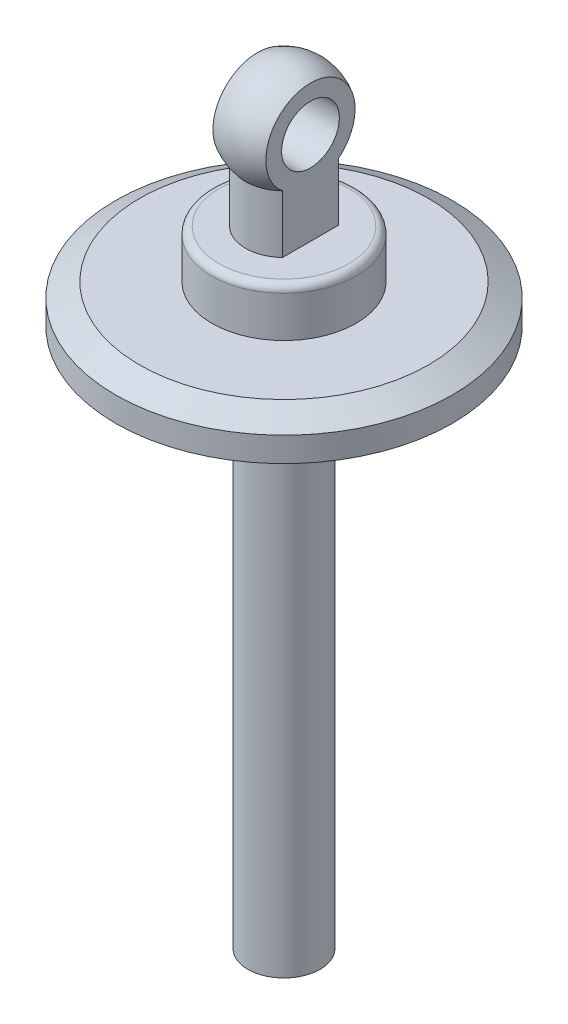
ISO-10303-21;
HEADER;
FILE_DESCRIPTION(('STEP AP214'),'2;1');
FILE_NAME('part.step','',(''),(''),'','','');
FILE_SCHEMA(('AUTOMOTIVE_DESIGN { 1 0 10303 214 1 1 1 1 }'));
ENDSEC;
DATA;
#1=APPLICATION_CONTEXT('core data for automotive mechanical design processes');
#2=APPLICATION_PROTOCOL_DEFINITION('international standard','automotive_design',2000,#1);
#3=PRODUCT_CONTEXT('',#1,'mechanical');
#4=PRODUCT('Part','Part','',(#3));
#5=PRODUCT_RELATED_PRODUCT_CATEGORY('part','',(#4));
#6=PRODUCT_DEFINITION_FORMATION('','',#4);
#7=PRODUCT_DEFINITION_CONTEXT('part definition',#1,'design');
#8=PRODUCT_DEFINITION('design','',#6,#7);
#9=PRODUCT_DEFINITION_SHAPE('','',#8);
#10=(LENGTH_UNIT() NAMED_UNIT(*) SI_UNIT(.MILLI.,.METRE.));
#11=(NAMED_UNIT(*) PLANE_ANGLE_UNIT() SI_UNIT($,.RADIAN.));
#12=(NAMED_UNIT(*) SI_UNIT($,.STERADIAN.) SOLID_ANGLE_UNIT());
#13=UNCERTAINTY_MEASURE_WITH_UNIT(LENGTH_MEASURE(1.E-05),#10,'distance_accuracy_value','');
#14=(GEOMETRIC_REPRESENTATION_CONTEXT(3) GLOBAL_UNCERTAINTY_ASSIGNED_CONTEXT((#13)) GLOBAL_UNIT_ASSIGNED_CONTEXT((#10,
#11,#12)) REPRESENTATION_CONTEXT('',''));
#15=CARTESIAN_POINT('',(0.,0.,0.));
#16=DIRECTION('',(0.,0.,1.));
#17=DIRECTION('',(1.,0.,0.));
#18=AXIS2_PLACEMENT_3D('',#15,#16,#17);
#19=CARTESIAN_POINT('',(0.,-80.,0.));
#20=DIRECTION('',(0.,-1.,0.));
#21=DIRECTION('',(1.,0.,0.));
#22=AXIS2_PLACEMENT_3D('',#19,#20,#21);
#23=CYLINDRICAL_SURFACE('',#22,7.99999999999998);
#24=CARTESIAN_POINT('',(0.,62.,0.));
#25=DIRECTION('',(0.,-1.,0.));
#26=DIRECTION('',(1.,0.,0.));
#27=AXIS2_PLACEMENT_3D('',#24,#25,#26);
#28=CIRCLE('',#27,7.99999999999998);
#29=CARTESIAN_POINT('',(-5.5,62.,-5.80947501931112));
#30=VERTEX_POINT('',#29);
#31=CARTESIAN_POINT('',(5.5,62.,-5.8094750193111));
#32=VERTEX_POINT('',#31);
#33=EDGE_CURVE('E102',#30,#32,#28,.T.);
#34=ORIENTED_EDGE('',*,*,#33,.T.);
#35=DIRECTION('',(0.,-1.,0.));
#36=VECTOR('',#35,1.);
#37=CARTESIAN_POINT('',(5.49999999999998,-80.,-5.80947501931111));
#38=LINE('',#37,#36);
#39=CARTESIAN_POINT('',(5.5,50.,-5.80947501931107));
#40=VERTEX_POINT('',#39);
#41=EDGE_CURVE('E60',#32,#40,#38,.T.);
#42=ORIENTED_EDGE('',*,*,#41,.T.);
#43=CARTESIAN_POINT('',(0.,50.,0.));
#44=DIRECTION('',(0.,-1.,0.));
#45=DIRECTION('',(1.,0.,0.));
#46=AXIS2_PLACEMENT_3D('',#43,#44,#45);
#47=CIRCLE('',#46,7.99999999999998);
#48=CARTESIAN_POINT('',(-5.5,50.,-5.80947501931112));
#49=VERTEX_POINT('',#48);
#50=EDGE_CURVE('E100',#49,#40,#47,.T.);
#51=ORIENTED_EDGE('',*,*,#50,.F.);
#52=DIRECTION('',(0.,-1.,0.));
#53=VECTOR('',#52,1.);
#54=CARTESIAN_POINT('',(-5.49999999999998,-80.,-5.80947501931111));
#55=LINE('',#54,#53);
#56=EDGE_CURVE('E424',#30,#49,#55,.T.);
#57=ORIENTED_EDGE('',*,*,#56,.F.);
#58=EDGE_LOOP('',(#34,#42,#51,#57));
#59=FACE_BOUND('',#58,.T.);
#60=ADVANCED_FACE('F43',(#59),#23,.T.);
#61=CARTESIAN_POINT('',(5.5,50.,5.80947501931107));
#62=VERTEX_POINT('',#61);
#63=CARTESIAN_POINT('',(-5.5,50.,5.80947501931112));
#64=VERTEX_POINT('',#63);
#65=EDGE_CURVE('E112',#62,#64,#47,.T.);
#66=ORIENTED_EDGE('',*,*,#65,.F.);
#67=DIRECTION('',(0.,-1.,0.));
#68=VECTOR('',#67,1.);
#69=CARTESIAN_POINT('',(5.49999999999998,-80.,5.80947501931111));
#70=LINE('',#69,#68);
#71=CARTESIAN_POINT('',(5.5,62.,5.8094750193111));
#72=VERTEX_POINT('',#71);
#73=EDGE_CURVE('E88',#62,#72,#70,.F.);
#74=ORIENTED_EDGE('',*,*,#73,.T.);
#75=CARTESIAN_POINT('',(-5.5,62.,5.80947501931112));
#76=VERTEX_POINT('',#75);
#77=EDGE_CURVE('E68',#72,#76,#28,.T.);
#78=ORIENTED_EDGE('',*,*,#77,.T.);
#79=DIRECTION('',(0.,-1.,0.));
#80=VECTOR('',#79,1.);
#81=CARTESIAN_POINT('',(-5.49999999999998,-80.,5.80947501931111));
#82=LINE('',#81,#80);
#83=EDGE_CURVE('E422',#64,#76,#82,.F.);
#84=ORIENTED_EDGE('',*,*,#83,.F.);
#85=EDGE_LOOP('',(#66,#74,#78,#84));
#86=FACE_BOUND('',#85,.T.);
#87=ADVANCED_FACE('F178',(#86),#23,.T.);
#88=CARTESIAN_POINT('',(0.,69.2222222222222,0.));
#89=DIRECTION('',(0.,-1.,0.));
#90=DIRECTION('',(-1.,0.,0.));
#91=AXIS2_PLACEMENT_3D('',#88,#89,#90);
#92=SPHERICAL_SURFACE('',#91,10.7777777777778);
#93=ORIENTED_EDGE('',*,*,#77,.F.);
#94=CARTESIAN_POINT('',(5.5,69.2222222222222,0.));
#95=DIRECTION('',(-1.,0.,0.));
#96=DIRECTION('',(0.,-1.,0.));
#97=AXIS2_PLACEMENT_3D('',#94,#95,#96);
#98=CIRCLE('',#97,9.26879138977463);
#99=EDGE_CURVE('E93',#72,#32,#98,.T.);
#100=ORIENTED_EDGE('',*,*,#99,.T.);
#101=ORIENTED_EDGE('',*,*,#33,.F.);
#102=CARTESIAN_POINT('',(-5.5,69.2222222222222,0.));
#103=DIRECTION('',(-1.,0.,0.));
#104=DIRECTION('',(0.,-1.,0.));
#105=AXIS2_PLACEMENT_3D('',#102,#103,#104);
#106=CIRCLE('',#105,9.26879138977463);
#107=EDGE_CURVE('E419',#76,#30,#106,.T.);
#108=ORIENTED_EDGE('',*,*,#107,.F.);
#109=EDGE_LOOP('',(#93,#100,#101,#108));
#110=FACE_BOUND('',#109,.T.);
#111=ADVANCED_FACE('F183',(#110),#92,.T.);
#112=CARTESIAN_POINT('',(0.,-80.,0.));
#113=DIRECTION('',(0.,1.,0.));
#114=DIRECTION('',(-1.,0.,0.));
#115=AXIS2_PLACEMENT_3D('',#112,#113,#114);
#116=PLANE('',#115);
#117=CARTESIAN_POINT('',(0.,-80.,0.));
#118=DIRECTION('',(0.,-1.,0.));
#119=DIRECTION('',(1.,0.,0.));
#120=AXIS2_PLACEMENT_3D('',#117,#118,#119);
#121=CIRCLE('',#120,7.5);
#122=CARTESIAN_POINT('',(7.5,-80.,0.));
#123=VERTEX_POINT('',#122);
#124=EDGE_CURVE('E137',#123,#123,#121,.T.);
#125=ORIENTED_EDGE('',*,*,#124,.T.);
#126=EDGE_LOOP('',(#125));
#127=FACE_BOUND('',#126,.T.);
#128=ADVANCED_FACE('F217',(#127),#116,.F.);
#129=CARTESIAN_POINT('',(0.,-80.,0.));
#130=DIRECTION('',(0.,-1.,0.));
#131=DIRECTION('',(1.,0.,0.));
#132=AXIS2_PLACEMENT_3D('',#129,#130,#131);
#133=CYLINDRICAL_SURFACE('',#132,7.49999999999999);
#134=ORIENTED_EDGE('',*,*,#124,.F.);
#135=EDGE_LOOP('',(#134));
#136=FACE_BOUND('',#135,.T.);
#137=CARTESIAN_POINT('',(0.,20.,0.));
#138=DIRECTION('',(0.,-1.,0.));
#139=DIRECTION('',(1.,0.,0.));
#140=AXIS2_PLACEMENT_3D('',#137,#138,#139);
#141=CIRCLE('',#140,7.49999999999998);
#142=CARTESIAN_POINT('',(7.49999999999996,20.,0.));
#143=VERTEX_POINT('',#142);
#144=EDGE_CURVE('E133',#143,#143,#141,.T.);
#145=ORIENTED_EDGE('',*,*,#144,.T.);
#146=EDGE_LOOP('',(#145));
#147=FACE_BOUND('',#146,.T.);
#148=ADVANCED_FACE('F213',(#136,#147),#133,.T.);
#149=CARTESIAN_POINT('',(-7.5,20.,0.));
#150=DIRECTION('',(0.,1.,0.));
#151=DIRECTION('',(-1.,0.,0.));
#152=AXIS2_PLACEMENT_3D('',#149,#150,#151);
#153=PLANE('',#152);
#154=ORIENTED_EDGE('',*,*,#144,.F.);
#155=EDGE_LOOP('',(#154));
#156=FACE_BOUND('',#155,.T.);
#157=CARTESIAN_POINT('',(0.,20.,0.));
#158=DIRECTION('',(0.,-1.,0.));
#159=DIRECTION('',(1.,0.,0.));
#160=AXIS2_PLACEMENT_3D('',#157,#158,#159);
#161=CIRCLE('',#160,14.5);
#162=CARTESIAN_POINT('',(14.5,20.,0.));
#163=VERTEX_POINT('',#162);
#164=EDGE_CURVE('E129',#163,#163,#161,.T.);
#165=ORIENTED_EDGE('',*,*,#164,.T.);
#166=EDGE_LOOP('',(#165));
#167=FACE_BOUND('',#166,.T.);
#168=ADVANCED_FACE('F209',(#156,#167),#153,.F.);
#169=CARTESIAN_POINT('',(0.,-80.,0.));
#170=DIRECTION('',(0.,-1.,0.));
#171=DIRECTION('',(1.,0.,0.));
#172=AXIS2_PLACEMENT_3D('',#169,#170,#171);
#173=CYLINDRICAL_SURFACE('',#172,14.5);
#174=CARTESIAN_POINT('',(0.,24.9999999999999,0.));
#175=DIRECTION('',(0.,-1.,0.));
#176=DIRECTION('',(1.,0.,0.));
#177=AXIS2_PLACEMENT_3D('',#174,#175,#176);
#178=CIRCLE('',#177,14.5);
#179=CARTESIAN_POINT('',(14.5,24.9999999999999,0.));
#180=VERTEX_POINT('',#179);
#181=EDGE_CURVE('E141',#180,#180,#178,.T.);
#182=ORIENTED_EDGE('',*,*,#181,.T.);
#183=EDGE_LOOP('',(#182));
#184=FACE_BOUND('',#183,.T.);
#185=ORIENTED_EDGE('',*,*,#164,.F.);
#186=EDGE_LOOP('',(#185));
#187=FACE_BOUND('',#186,.T.);
#188=ADVANCED_FACE('F205',(#184,#187),#173,.T.);
#189=CARTESIAN_POINT('',(0.,-80.,0.));
#190=DIRECTION('',(0.,-1.,0.));
#191=DIRECTION('',(1.,0.,0.));
#192=AXIS2_PLACEMENT_3D('',#189,#190,#191);
#193=CYLINDRICAL_SURFACE('',#192,9.99999999999998);
#194=CARTESIAN_POINT('',(0.,29.5,0.));
#195=DIRECTION('',(0.,-1.,0.));
#196=DIRECTION('',(1.,0.,0.));
#197=AXIS2_PLACEMENT_3D('',#194,#195,#196);
#198=CIRCLE('',#197,9.99999999999998);
#199=CARTESIAN_POINT('',(9.99999999999996,29.5,0.));
#200=VERTEX_POINT('',#199);
#201=EDGE_CURVE('E145',#200,#200,#198,.F.);
#202=ORIENTED_EDGE('',*,*,#201,.T.);
#203=EDGE_LOOP('',(#202));
#204=FACE_BOUND('',#203,.T.);
#205=CARTESIAN_POINT('',(0.,32.,0.));
#206=DIRECTION('',(0.,-1.,0.));
#207=DIRECTION('',(1.,0.,0.));
#208=AXIS2_PLACEMENT_3D('',#205,#206,#207);
#209=CIRCLE('',#208,9.99999999999998);
#210=CARTESIAN_POINT('',(9.99999999999996,32.,0.));
#211=VERTEX_POINT('',#210);
#212=EDGE_CURVE('E125',#211,#211,#209,.T.);
#213=ORIENTED_EDGE('',*,*,#212,.T.);
#214=EDGE_LOOP('',(#213));
#215=FACE_BOUND('',#214,.T.);
#216=ADVANCED_FACE('F201',(#204,#215),#193,.T.);
#217=CARTESIAN_POINT('',(-10.,32.,0.));
#218=DIRECTION('',(0.,1.,0.));
#219=DIRECTION('',(-1.,0.,0.));
#220=AXIS2_PLACEMENT_3D('',#217,#218,#219);
#221=PLANE('',#220);
#222=ORIENTED_EDGE('',*,*,#212,.F.);
#223=EDGE_LOOP('',(#222));
#224=FACE_BOUND('',#223,.T.);
#225=CARTESIAN_POINT('',(0.,32.,0.));
#226=DIRECTION('',(0.,-1.,0.));
#227=DIRECTION('',(1.,0.,0.));
#228=AXIS2_PLACEMENT_3D('',#225,#226,#227);
#229=CIRCLE('',#228,35.);
#230=CARTESIAN_POINT('',(35.,32.,0.));
#231=VERTEX_POINT('',#230);
#232=EDGE_CURVE('E117',#231,#231,#229,.T.);
#233=ORIENTED_EDGE('',*,*,#232,.T.);
#234=EDGE_LOOP('',(#233));
#235=FACE_BOUND('',#234,.T.);
#236=ADVANCED_FACE('F197',(#224,#235),#221,.F.);
#237=CARTESIAN_POINT('',(0.,-80.,0.));
#238=DIRECTION('',(0.,-1.,0.));
#239=DIRECTION('',(1.,0.,0.));
#240=AXIS2_PLACEMENT_3D('',#237,#238,#239);
#241=CYLINDRICAL_SURFACE('',#240,35.);
#242=CARTESIAN_POINT('',(0.,37.1132486540519,0.));
#243=DIRECTION('',(0.,-1.,0.));
#244=DIRECTION('',(1.,0.,0.));
#245=AXIS2_PLACEMENT_3D('',#242,#243,#244);
#246=CIRCLE('',#245,35.);
#247=CARTESIAN_POINT('',(35.,37.1132486540519,0.));
#248=VERTEX_POINT('',#247);
#249=EDGE_CURVE('E149',#248,#248,#246,.T.);
#250=ORIENTED_EDGE('',*,*,#249,.T.);
#251=EDGE_LOOP('',(#250));
#252=FACE_BOUND('',#251,.T.);
#253=ORIENTED_EDGE('',*,*,#232,.F.);
#254=EDGE_LOOP('',(#253));
#255=FACE_BOUND('',#254,.T.);
#256=ADVANCED_FACE('F193',(#252,#255),#241,.T.);
#257=CARTESIAN_POINT('',(-35.,40.,0.));
#258=DIRECTION('',(0.,-1.,0.));
#259=DIRECTION('',(1.,0.,0.));
#260=AXIS2_PLACEMENT_3D('',#257,#258,#259);
#261=PLANE('',#260);
#262=CARTESIAN_POINT('',(0.,40.,0.));
#263=DIRECTION('',(0.,-1.,0.));
#264=DIRECTION('',(1.,0.,0.));
#265=AXIS2_PLACEMENT_3D('',#262,#263,#264);
#266=CIRCLE('',#265,29.9999999999999);
#267=CARTESIAN_POINT('',(29.9999999999998,40.,0.));
#268=VERTEX_POINT('',#267);
#269=EDGE_CURVE('E153',#268,#268,#266,.F.);
#270=ORIENTED_EDGE('',*,*,#269,.T.);
#271=EDGE_LOOP('',(#270));
#272=FACE_BOUND('',#271,.T.);
#273=CARTESIAN_POINT('',(0.,40.,0.));
#274=DIRECTION('',(0.,-1.,0.));
#275=DIRECTION('',(1.,0.,0.));
#276=AXIS2_PLACEMENT_3D('',#273,#274,#275);
#277=CIRCLE('',#276,15.);
#278=CARTESIAN_POINT('',(15.,40.,0.));
#279=VERTEX_POINT('',#278);
#280=EDGE_CURVE('E111',#279,#279,#277,.T.);
#281=ORIENTED_EDGE('',*,*,#280,.T.);
#282=EDGE_LOOP('',(#281));
#283=FACE_BOUND('',#282,.T.);
#284=ADVANCED_FACE('F190',(#272,#283),#261,.F.);
#285=CARTESIAN_POINT('',(0.,-80.,0.));
#286=DIRECTION('',(0.,-1.,0.));
#287=DIRECTION('',(1.,0.,0.));
#288=AXIS2_PLACEMENT_3D('',#285,#286,#287);
#289=CYLINDRICAL_SURFACE('',#288,15.);
#290=CARTESIAN_POINT('',(0.,48.5,0.));
#291=DIRECTION('',(0.,-1.,0.));
#292=DIRECTION('',(1.,0.,0.));
#293=AXIS2_PLACEMENT_3D('',#290,#291,#292);
#294=CIRCLE('',#293,15.);
#295=CARTESIAN_POINT('',(15.,48.5,0.));
#296=VERTEX_POINT('',#295);
#297=EDGE_CURVE('E53',#296,#296,#294,.T.);
#298=ORIENTED_EDGE('',*,*,#297,.T.);
#299=EDGE_LOOP('',(#298));
#300=FACE_BOUND('',#299,.T.);
#301=ORIENTED_EDGE('',*,*,#280,.F.);
#302=EDGE_LOOP('',(#301));
#303=FACE_BOUND('',#302,.T.);
#304=ADVANCED_FACE('F161',(#300,#303),#289,.T.);
#305=CARTESIAN_POINT('',(-15.,50.,0.));
#306=DIRECTION('',(0.,-1.,0.));
#307=DIRECTION('',(1.,0.,0.));
#308=AXIS2_PLACEMENT_3D('',#305,#306,#307);
#309=PLANE('',#308);
#310=ORIENTED_EDGE('',*,*,#50,.T.);
#311=DIRECTION('',(0.,0.,1.));
#312=VECTOR('',#311,1.);
#313=CARTESIAN_POINT('',(5.5,50.,-40.));
#314=LINE('',#313,#312);
#315=EDGE_CURVE('E86',#40,#62,#314,.T.);
#316=ORIENTED_EDGE('',*,*,#315,.T.);
#317=ORIENTED_EDGE('',*,*,#65,.T.);
#318=DIRECTION('',(0.,0.,1.));
#319=VECTOR('',#318,1.);
#320=CARTESIAN_POINT('',(-5.5,50.,-40.));
#321=LINE('',#320,#319);
#322=EDGE_CURVE('E104',#49,#64,#321,.T.);
#323=ORIENTED_EDGE('',*,*,#322,.F.);
#324=EDGE_LOOP('',(#310,#316,#317,#323));
#325=FACE_BOUND('',#324,.T.);
#326=CARTESIAN_POINT('',(0.,50.,0.));
#327=DIRECTION('',(0.,-1.,0.));
#328=DIRECTION('',(1.,0.,0.));
#329=AXIS2_PLACEMENT_3D('',#326,#327,#328);
#330=CIRCLE('',#329,13.5);
#331=CARTESIAN_POINT('',(13.5,50.,0.));
#332=VERTEX_POINT('',#331);
#333=EDGE_CURVE('E11',#332,#332,#330,.F.);
#334=ORIENTED_EDGE('',*,*,#333,.T.);
#335=EDGE_LOOP('',(#334));
#336=FACE_BOUND('',#335,.T.);
#337=ADVANCED_FACE('F107',(#325,#336),#309,.F.);
#338=CARTESIAN_POINT('',(0.,24.9999999999999,0.));
#339=DIRECTION('',(0.,-1.,0.));
#340=DIRECTION('',(1.,0.,0.));
#341=AXIS2_PLACEMENT_3D('',#338,#339,#340);
#342=CONICAL_SURFACE('',#341,14.5,0.785398163397443);
#343=ORIENTED_EDGE('',*,*,#201,.F.);
#344=EDGE_LOOP('',(#343));
#345=FACE_BOUND('',#344,.T.);
#346=ORIENTED_EDGE('',*,*,#181,.F.);
#347=EDGE_LOOP('',(#346));
#348=FACE_BOUND('',#347,.T.);
#349=ADVANCED_FACE('F174',(#345,#348),#342,.T.);
#350=CARTESIAN_POINT('',(0.,37.1132486540519,0.));
#351=DIRECTION('',(0.,-1.,0.));
#352=DIRECTION('',(1.,0.,0.));
#353=AXIS2_PLACEMENT_3D('',#350,#351,#352);
#354=CONICAL_SURFACE('',#353,35.,1.0471975511966);
#355=ORIENTED_EDGE('',*,*,#269,.F.);
#356=EDGE_LOOP('',(#355));
#357=FACE_BOUND('',#356,.T.);
#358=ORIENTED_EDGE('',*,*,#249,.F.);
#359=EDGE_LOOP('',(#358));
#360=FACE_BOUND('',#359,.T.);
#361=ADVANCED_FACE('F166',(#357,#360),#354,.T.);
#362=CARTESIAN_POINT('',(0.,48.5,0.));
#363=DIRECTION('',(0.,-1.,0.));
#364=DIRECTION('',(1.,0.,0.));
#365=AXIS2_PLACEMENT_3D('',#362,#363,#364);
#366=TOROIDAL_SURFACE('',#365,13.5,1.5);
#367=ORIENTED_EDGE('',*,*,#333,.F.);
#368=EDGE_LOOP('',(#367));
#369=FACE_BOUND('',#368,.T.);
#370=ORIENTED_EDGE('',*,*,#297,.F.);
#371=EDGE_LOOP('',(#370));
#372=FACE_BOUND('',#371,.T.);
#373=ADVANCED_FACE('F45',(#369,#372),#366,.T.);
#374=CARTESIAN_POINT('',(-5.49999999999999,0.,-40.));
#375=DIRECTION('',(-1.,0.,0.));
#376=DIRECTION('',(0.,-1.,0.));
#377=AXIS2_PLACEMENT_3D('',#374,#375,#376);
#378=PLANE('',#377);
#379=CARTESIAN_POINT('',(-5.5,69.2222222222222,0.));
#380=DIRECTION('',(-1.,0.,0.));
#381=DIRECTION('',(0.,-1.,0.));
#382=AXIS2_PLACEMENT_3D('',#379,#380,#381);
#383=CIRCLE('',#382,6.);
#384=CARTESIAN_POINT('',(-5.5,63.2222222222222,0.));
#385=VERTEX_POINT('',#384);
#386=EDGE_CURVE('E94',#385,#385,#383,.T.);
#387=ORIENTED_EDGE('',*,*,#386,.F.);
#388=EDGE_LOOP('',(#387));
#389=FACE_BOUND('',#388,.T.);
#390=ORIENTED_EDGE('',*,*,#56,.T.);
#391=ORIENTED_EDGE('',*,*,#322,.T.);
#392=ORIENTED_EDGE('',*,*,#83,.T.);
#393=ORIENTED_EDGE('',*,*,#107,.T.);
#394=EDGE_LOOP('',(#390,#391,#392,#393));
#395=FACE_BOUND('',#394,.T.);
#396=ADVANCED_FACE('F165',(#389,#395),#378,.T.);
#397=CARTESIAN_POINT('',(5.49999999999999,0.,-40.));
#398=DIRECTION('',(-1.,0.,0.));
#399=DIRECTION('',(0.,-1.,0.));
#400=AXIS2_PLACEMENT_3D('',#397,#398,#399);
#401=PLANE('',#400);
#402=CARTESIAN_POINT('',(5.5,69.2222222222222,0.));
#403=DIRECTION('',(-1.,0.,0.));
#404=DIRECTION('',(0.,-1.,0.));
#405=AXIS2_PLACEMENT_3D('',#402,#403,#404);
#406=CIRCLE('',#405,6.);
#407=CARTESIAN_POINT('',(5.5,63.2222222222222,0.));
#408=VERTEX_POINT('',#407);
#409=EDGE_CURVE('E47',#408,#408,#406,.T.);
#410=ORIENTED_EDGE('',*,*,#409,.T.);
#411=EDGE_LOOP('',(#410));
#412=FACE_BOUND('',#411,.T.);
#413=ORIENTED_EDGE('',*,*,#99,.F.);
#414=ORIENTED_EDGE('',*,*,#73,.F.);
#415=ORIENTED_EDGE('',*,*,#315,.F.);
#416=ORIENTED_EDGE('',*,*,#41,.F.);
#417=EDGE_LOOP('',(#413,#414,#415,#416));
#418=FACE_BOUND('',#417,.T.);
#419=ADVANCED_FACE('F87',(#412,#418),#401,.F.);
#420=CARTESIAN_POINT('',(-34.5,69.2222222222222,0.));
#421=DIRECTION('',(1.,0.,0.));
#422=DIRECTION('',(0.,1.,0.));
#423=AXIS2_PLACEMENT_3D('',#420,#421,#422);
#424=CYLINDRICAL_SURFACE('',#423,6.);
#425=ORIENTED_EDGE('',*,*,#386,.T.);
#426=EDGE_LOOP('',(#425));
#427=FACE_BOUND('',#426,.T.);
#428=ORIENTED_EDGE('',*,*,#409,.F.);
#429=EDGE_LOOP('',(#428));
#430=FACE_BOUND('',#429,.T.);
#431=ADVANCED_FACE('F281',(#427,#430),#424,.F.);
#432=CLOSED_SHELL('',(#60,#87,#111,#128,#148,#168,#188,#216,#236,#256,#284,#304,#337,#349,#361,
#373,#396,#419,#431));
#433=MANIFOLD_SOLID_BREP('B2',#432);
#434=ADVANCED_BREP_SHAPE_REPRESENTATION('',(#18,#433),#14);
#435=SHAPE_DEFINITION_REPRESENTATION(#9,#434);
ENDSEC;
END-ISO-10303-21;
